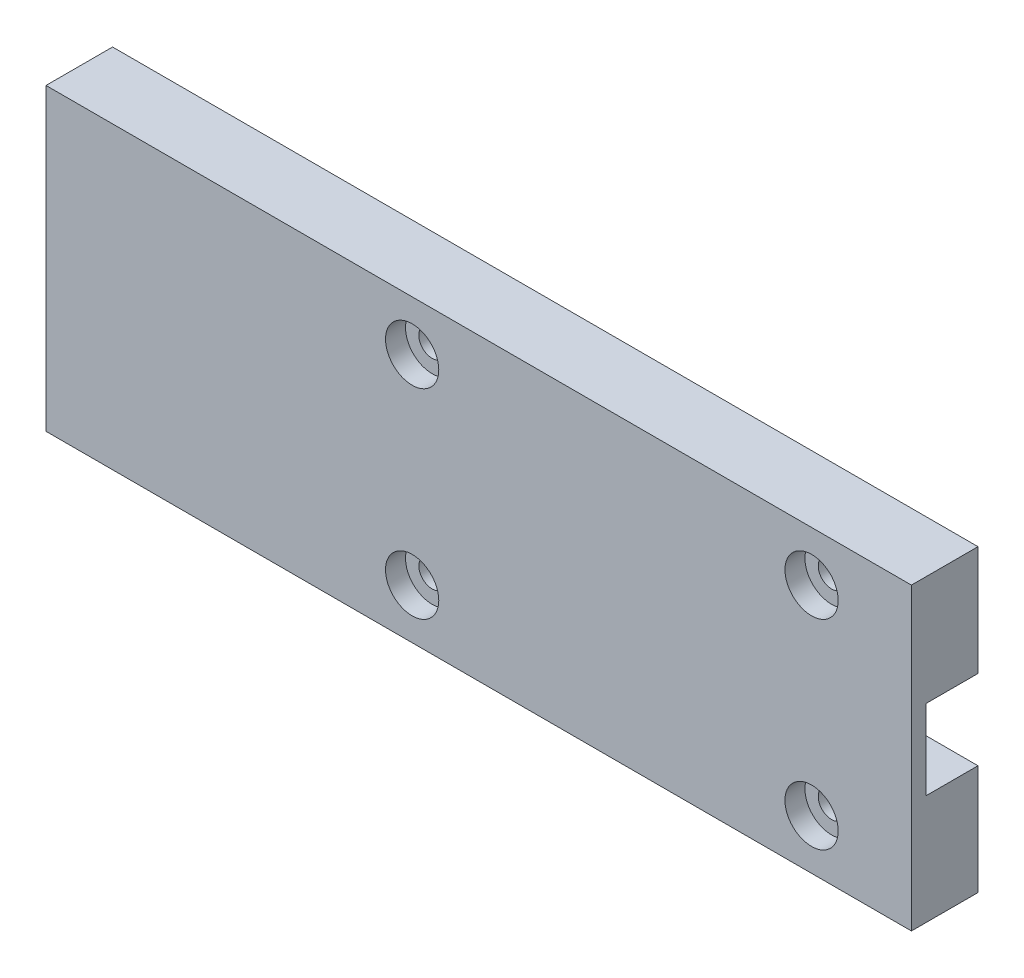
ISO-10303-21;
HEADER;
FILE_DESCRIPTION(('STEP AP214'),'2;1');
FILE_NAME('part.step','',(''),(''),'','','');
FILE_SCHEMA(('AUTOMOTIVE_DESIGN { 1 0 10303 214 1 1 1 1 }'));
ENDSEC;
DATA;
#1=APPLICATION_CONTEXT('core data for automotive mechanical design processes');
#2=APPLICATION_PROTOCOL_DEFINITION('international standard','automotive_design',2000,#1);
#3=PRODUCT_CONTEXT('',#1,'mechanical');
#4=PRODUCT('Part','Part','',(#3));
#5=PRODUCT_RELATED_PRODUCT_CATEGORY('part','',(#4));
#6=PRODUCT_DEFINITION_FORMATION('','',#4);
#7=PRODUCT_DEFINITION_CONTEXT('part definition',#1,'design');
#8=PRODUCT_DEFINITION('design','',#6,#7);
#9=PRODUCT_DEFINITION_SHAPE('','',#8);
#10=(LENGTH_UNIT() NAMED_UNIT(*) SI_UNIT(.MILLI.,.METRE.));
#11=(NAMED_UNIT(*) PLANE_ANGLE_UNIT() SI_UNIT($,.RADIAN.));
#12=(NAMED_UNIT(*) SI_UNIT($,.STERADIAN.) SOLID_ANGLE_UNIT());
#13=UNCERTAINTY_MEASURE_WITH_UNIT(LENGTH_MEASURE(1.E-05),#10,'distance_accuracy_value','');
#14=(GEOMETRIC_REPRESENTATION_CONTEXT(3) GLOBAL_UNCERTAINTY_ASSIGNED_CONTEXT((#13)) GLOBAL_UNIT_ASSIGNED_CONTEXT((#10,
#11,#12)) REPRESENTATION_CONTEXT('',''));
#15=CARTESIAN_POINT('',(0.,0.,0.));
#16=DIRECTION('',(0.,0.,1.));
#17=DIRECTION('',(1.,0.,0.));
#18=AXIS2_PLACEMENT_3D('',#15,#16,#17);
#19=CARTESIAN_POINT('',(114.99999999989,37.4999999998989,0.));
#20=DIRECTION('',(0.,0.,1.));
#21=DIRECTION('',(1.,0.,0.));
#22=AXIS2_PLACEMENT_3D('',#19,#20,#21);
#23=CYLINDRICAL_SURFACE('',#22,2.);
#24=CARTESIAN_POINT('',(114.99999999989,37.4999999998989,0.));
#25=DIRECTION('',(0.,0.,1.));
#26=DIRECTION('',(1.,0.,0.));
#27=AXIS2_PLACEMENT_3D('',#24,#25,#26);
#28=CIRCLE('',#27,2.);
#29=CARTESIAN_POINT('',(116.99999999989,37.4999999998989,0.));
#30=VERTEX_POINT('',#29);
#31=EDGE_CURVE('E203',#30,#30,#28,.T.);
#32=ORIENTED_EDGE('',*,*,#31,.F.);
#33=EDGE_LOOP('',(#32));
#34=FACE_BOUND('',#33,.T.);
#35=CARTESIAN_POINT('',(114.99999999989,37.4999999998989,7.));
#36=DIRECTION('',(0.,0.,1.));
#37=DIRECTION('',(1.,0.,0.));
#38=AXIS2_PLACEMENT_3D('',#35,#36,#37);
#39=CIRCLE('',#38,2.);
#40=CARTESIAN_POINT('',(116.99999999989,37.4999999998989,7.));
#41=VERTEX_POINT('',#40);
#42=EDGE_CURVE('E39',#41,#41,#39,.F.);
#43=ORIENTED_EDGE('',*,*,#42,.F.);
#44=EDGE_LOOP('',(#43));
#45=FACE_BOUND('',#44,.T.);
#46=ADVANCED_FACE('F35',(#34,#45),#23,.F.);
#47=CARTESIAN_POINT('',(54.99999999989,7.49999999989891,0.));
#48=DIRECTION('',(0.,0.,1.));
#49=DIRECTION('',(1.,0.,0.));
#50=AXIS2_PLACEMENT_3D('',#47,#48,#49);
#51=CYLINDRICAL_SURFACE('',#50,2.);
#52=CARTESIAN_POINT('',(54.99999999989,7.49999999989891,0.));
#53=DIRECTION('',(0.,0.,1.));
#54=DIRECTION('',(1.,0.,0.));
#55=AXIS2_PLACEMENT_3D('',#52,#53,#54);
#56=CIRCLE('',#55,2.);
#57=CARTESIAN_POINT('',(56.99999999989,7.49999999989891,0.));
#58=VERTEX_POINT('',#57);
#59=EDGE_CURVE('E196',#58,#58,#56,.T.);
#60=ORIENTED_EDGE('',*,*,#59,.F.);
#61=EDGE_LOOP('',(#60));
#62=FACE_BOUND('',#61,.T.);
#63=CARTESIAN_POINT('',(54.99999999989,7.49999999989891,7.));
#64=DIRECTION('',(0.,0.,1.));
#65=DIRECTION('',(1.,0.,0.));
#66=AXIS2_PLACEMENT_3D('',#63,#64,#65);
#67=CIRCLE('',#66,2.);
#68=CARTESIAN_POINT('',(56.99999999989,7.49999999989891,7.));
#69=VERTEX_POINT('',#68);
#70=EDGE_CURVE('E256',#69,#69,#67,.F.);
#71=ORIENTED_EDGE('',*,*,#70,.F.);
#72=EDGE_LOOP('',(#71));
#73=FACE_BOUND('',#72,.T.);
#74=ADVANCED_FACE('F266',(#62,#73),#51,.F.);
#75=CARTESIAN_POINT('',(114.99999999989,7.49999999989892,0.));
#76=DIRECTION('',(0.,0.,1.));
#77=DIRECTION('',(1.,0.,0.));
#78=AXIS2_PLACEMENT_3D('',#75,#76,#77);
#79=CYLINDRICAL_SURFACE('',#78,2.);
#80=CARTESIAN_POINT('',(114.99999999989,7.49999999989892,0.));
#81=DIRECTION('',(0.,0.,1.));
#82=DIRECTION('',(1.,0.,0.));
#83=AXIS2_PLACEMENT_3D('',#80,#81,#82);
#84=CIRCLE('',#83,2.);
#85=CARTESIAN_POINT('',(116.99999999989,7.49999999989892,0.));
#86=VERTEX_POINT('',#85);
#87=EDGE_CURVE('E199',#86,#86,#84,.T.);
#88=ORIENTED_EDGE('',*,*,#87,.F.);
#89=EDGE_LOOP('',(#88));
#90=FACE_BOUND('',#89,.T.);
#91=CARTESIAN_POINT('',(114.99999999989,7.49999999989892,7.));
#92=DIRECTION('',(0.,0.,1.));
#93=DIRECTION('',(1.,0.,0.));
#94=AXIS2_PLACEMENT_3D('',#91,#92,#93);
#95=CIRCLE('',#94,2.);
#96=CARTESIAN_POINT('',(116.99999999989,7.49999999989892,7.));
#97=VERTEX_POINT('',#96);
#98=EDGE_CURVE('E254',#97,#97,#95,.F.);
#99=ORIENTED_EDGE('',*,*,#98,.F.);
#100=EDGE_LOOP('',(#99));
#101=FACE_BOUND('',#100,.T.);
#102=ADVANCED_FACE('F272',(#90,#101),#79,.F.);
#103=CARTESIAN_POINT('',(54.99999999989,37.4999999998989,0.));
#104=DIRECTION('',(0.,0.,1.));
#105=DIRECTION('',(1.,0.,0.));
#106=AXIS2_PLACEMENT_3D('',#103,#104,#105);
#107=CYLINDRICAL_SURFACE('',#106,2.);
#108=CARTESIAN_POINT('',(54.99999999989,37.4999999998989,0.));
#109=DIRECTION('',(0.,0.,1.));
#110=DIRECTION('',(1.,0.,0.));
#111=AXIS2_PLACEMENT_3D('',#108,#109,#110);
#112=CIRCLE('',#111,2.);
#113=CARTESIAN_POINT('',(56.99999999989,37.4999999998989,0.));
#114=VERTEX_POINT('',#113);
#115=EDGE_CURVE('E200',#114,#114,#112,.T.);
#116=ORIENTED_EDGE('',*,*,#115,.F.);
#117=EDGE_LOOP('',(#116));
#118=FACE_BOUND('',#117,.T.);
#119=CARTESIAN_POINT('',(54.99999999989,37.4999999998989,7.));
#120=DIRECTION('',(0.,0.,1.));
#121=DIRECTION('',(1.,0.,0.));
#122=AXIS2_PLACEMENT_3D('',#119,#120,#121);
#123=CIRCLE('',#122,2.);
#124=CARTESIAN_POINT('',(56.99999999989,37.4999999998989,7.));
#125=VERTEX_POINT('',#124);
#126=EDGE_CURVE('E193',#125,#125,#123,.F.);
#127=ORIENTED_EDGE('',*,*,#126,.F.);
#128=EDGE_LOOP('',(#127));
#129=FACE_BOUND('',#128,.T.);
#130=ADVANCED_FACE('F310',(#118,#129),#107,.F.);
#131=CARTESIAN_POINT('',(0.,0.,10.));
#132=DIRECTION('',(1.,0.,0.));
#133=DIRECTION('',(0.,0.,-1.));
#134=AXIS2_PLACEMENT_3D('',#131,#132,#133);
#135=PLANE('',#134);
#136=DIRECTION('',(0.,-1.,0.));
#137=VECTOR('',#136,1.);
#138=CARTESIAN_POINT('',(0.,0.,0.));
#139=LINE('',#138,#137);
#140=CARTESIAN_POINT('',(0.,44.9999999997978,0.));
#141=VERTEX_POINT('',#140);
#142=CARTESIAN_POINT('',(0.,0.,0.));
#143=VERTEX_POINT('',#142);
#144=EDGE_CURVE('E223',#141,#143,#139,.T.);
#145=ORIENTED_EDGE('',*,*,#144,.T.);
#146=DIRECTION('',(0.,0.,-1.));
#147=VECTOR('',#146,1.);
#148=CARTESIAN_POINT('',(0.,0.,10.));
#149=LINE('',#148,#147);
#150=CARTESIAN_POINT('',(0.,0.,10.));
#151=VERTEX_POINT('',#150);
#152=EDGE_CURVE('E11',#151,#143,#149,.T.);
#153=ORIENTED_EDGE('',*,*,#152,.F.);
#154=DIRECTION('',(0.,-1.,0.));
#155=VECTOR('',#154,1.);
#156=CARTESIAN_POINT('',(0.,0.,10.));
#157=LINE('',#156,#155);
#158=CARTESIAN_POINT('',(0.,44.9999999997978,10.));
#159=VERTEX_POINT('',#158);
#160=EDGE_CURVE('E225',#159,#151,#157,.T.);
#161=ORIENTED_EDGE('',*,*,#160,.F.);
#162=DIRECTION('',(0.,0.,-1.));
#163=VECTOR('',#162,1.);
#164=CARTESIAN_POINT('',(0.,44.9999999997978,10.));
#165=LINE('',#164,#163);
#166=EDGE_CURVE('E235',#159,#141,#165,.T.);
#167=ORIENTED_EDGE('',*,*,#166,.T.);
#168=EDGE_LOOP('',(#145,#153,#161,#167));
#169=FACE_BOUND('',#168,.T.);
#170=ADVANCED_FACE('F37',(#169),#135,.F.);
#171=CARTESIAN_POINT('',(0.,0.,10.));
#172=DIRECTION('',(0.,1.,0.));
#173=DIRECTION('',(0.,0.,1.));
#174=AXIS2_PLACEMENT_3D('',#171,#172,#173);
#175=PLANE('',#174);
#176=DIRECTION('',(1.,0.,0.));
#177=VECTOR('',#176,1.);
#178=CARTESIAN_POINT('',(0.,0.,0.));
#179=LINE('',#178,#177);
#180=CARTESIAN_POINT('',(129.99999999989,0.,0.));
#181=VERTEX_POINT('',#180);
#182=EDGE_CURVE('E238',#143,#181,#179,.T.);
#183=ORIENTED_EDGE('',*,*,#182,.T.);
#184=DIRECTION('',(0.,0.,-1.));
#185=VECTOR('',#184,1.);
#186=CARTESIAN_POINT('',(129.99999999989,0.,10.));
#187=LINE('',#186,#185);
#188=CARTESIAN_POINT('',(129.99999999989,0.,10.));
#189=VERTEX_POINT('',#188);
#190=EDGE_CURVE('E44',#189,#181,#187,.T.);
#191=ORIENTED_EDGE('',*,*,#190,.F.);
#192=DIRECTION('',(1.,0.,0.));
#193=VECTOR('',#192,1.);
#194=CARTESIAN_POINT('',(0.,0.,10.));
#195=LINE('',#194,#193);
#196=EDGE_CURVE('E228',#151,#189,#195,.T.);
#197=ORIENTED_EDGE('',*,*,#196,.F.);
#198=ORIENTED_EDGE('',*,*,#152,.T.);
#199=EDGE_LOOP('',(#183,#191,#197,#198));
#200=FACE_BOUND('',#199,.T.);
#201=ADVANCED_FACE('F303',(#200),#175,.F.);
#202=CARTESIAN_POINT('',(129.99999999989,0.,10.));
#203=DIRECTION('',(-1.,0.,0.));
#204=DIRECTION('',(0.,0.,1.));
#205=AXIS2_PLACEMENT_3D('',#202,#203,#204);
#206=PLANE('',#205);
#207=DIRECTION('',(0.,-1.,0.));
#208=VECTOR('',#207,1.);
#209=CARTESIAN_POINT('',(129.99999999989,16.5,7.8));
#210=LINE('',#209,#208);
#211=CARTESIAN_POINT('',(129.99999999989,28.4999999997978,7.8));
#212=VERTEX_POINT('',#211);
#213=CARTESIAN_POINT('',(129.99999999989,16.5,7.8));
#214=VERTEX_POINT('',#213);
#215=EDGE_CURVE('E209',#212,#214,#210,.T.);
#216=ORIENTED_EDGE('',*,*,#215,.F.);
#217=DIRECTION('',(0.,0.,-1.));
#218=VECTOR('',#217,1.);
#219=CARTESIAN_POINT('',(129.99999999989,28.4999999997978,7.8));
#220=LINE('',#219,#218);
#221=CARTESIAN_POINT('',(129.99999999989,28.4999999997978,0.));
#222=VERTEX_POINT('',#221);
#223=EDGE_CURVE('E220',#212,#222,#220,.T.);
#224=ORIENTED_EDGE('',*,*,#223,.T.);
#225=DIRECTION('',(0.,1.,0.));
#226=VECTOR('',#225,1.);
#227=CARTESIAN_POINT('',(129.99999999989,0.,0.));
#228=LINE('',#227,#226);
#229=CARTESIAN_POINT('',(129.99999999989,44.9999999997978,0.));
#230=VERTEX_POINT('',#229);
#231=EDGE_CURVE('E240',#222,#230,#228,.T.);
#232=ORIENTED_EDGE('',*,*,#231,.T.);
#233=DIRECTION('',(0.,0.,-1.));
#234=VECTOR('',#233,1.);
#235=CARTESIAN_POINT('',(129.99999999989,44.9999999997978,10.));
#236=LINE('',#235,#234);
#237=CARTESIAN_POINT('',(129.99999999989,44.9999999997978,10.));
#238=VERTEX_POINT('',#237);
#239=EDGE_CURVE('E247',#238,#230,#236,.T.);
#240=ORIENTED_EDGE('',*,*,#239,.F.);
#241=DIRECTION('',(0.,1.,0.));
#242=VECTOR('',#241,1.);
#243=CARTESIAN_POINT('',(129.99999999989,0.,10.));
#244=LINE('',#243,#242);
#245=EDGE_CURVE('E231',#189,#238,#244,.T.);
#246=ORIENTED_EDGE('',*,*,#245,.F.);
#247=ORIENTED_EDGE('',*,*,#190,.T.);
#248=CARTESIAN_POINT('',(129.99999999989,16.5,0.));
#249=VERTEX_POINT('',#248);
#250=EDGE_CURVE('E241',#181,#249,#228,.T.);
#251=ORIENTED_EDGE('',*,*,#250,.T.);
#252=DIRECTION('',(0.,0.,-1.));
#253=VECTOR('',#252,1.);
#254=CARTESIAN_POINT('',(129.99999999989,16.5,7.8));
#255=LINE('',#254,#253);
#256=EDGE_CURVE('E60',#214,#249,#255,.T.);
#257=ORIENTED_EDGE('',*,*,#256,.F.);
#258=EDGE_LOOP('',(#216,#224,#232,#240,#246,#247,#251,#257));
#259=FACE_BOUND('',#258,.T.);
#260=ADVANCED_FACE('F300',(#259),#206,.F.);
#261=CARTESIAN_POINT('',(0.,44.9999999997978,10.));
#262=DIRECTION('',(0.,-1.,0.));
#263=DIRECTION('',(0.,0.,-1.));
#264=AXIS2_PLACEMENT_3D('',#261,#262,#263);
#265=PLANE('',#264);
#266=DIRECTION('',(-1.,0.,0.));
#267=VECTOR('',#266,1.);
#268=CARTESIAN_POINT('',(0.,44.9999999997978,0.));
#269=LINE('',#268,#267);
#270=EDGE_CURVE('E229',#230,#141,#269,.T.);
#271=ORIENTED_EDGE('',*,*,#270,.T.);
#272=ORIENTED_EDGE('',*,*,#166,.F.);
#273=DIRECTION('',(-1.,0.,0.));
#274=VECTOR('',#273,1.);
#275=CARTESIAN_POINT('',(0.,44.9999999997978,10.));
#276=LINE('',#275,#274);
#277=EDGE_CURVE('E233',#238,#159,#276,.T.);
#278=ORIENTED_EDGE('',*,*,#277,.F.);
#279=ORIENTED_EDGE('',*,*,#239,.T.);
#280=EDGE_LOOP('',(#271,#272,#278,#279));
#281=FACE_BOUND('',#280,.T.);
#282=ADVANCED_FACE('F293',(#281),#265,.F.);
#283=CARTESIAN_POINT('',(0.,0.,10.));
#284=DIRECTION('',(0.,0.,-1.));
#285=DIRECTION('',(-1.,0.,0.));
#286=AXIS2_PLACEMENT_3D('',#283,#284,#285);
#287=PLANE('',#286);
#288=CARTESIAN_POINT('',(54.99999999989,7.49999999989891,10.));
#289=DIRECTION('',(0.,0.,1.));
#290=DIRECTION('',(1.,0.,0.));
#291=AXIS2_PLACEMENT_3D('',#288,#289,#290);
#292=CIRCLE('',#291,4.00000000000001);
#293=CARTESIAN_POINT('',(58.99999999989,7.49999999989891,10.));
#294=VERTEX_POINT('',#293);
#295=EDGE_CURVE('E171',#294,#294,#292,.T.);
#296=ORIENTED_EDGE('',*,*,#295,.F.);
#297=EDGE_LOOP('',(#296));
#298=FACE_BOUND('',#297,.T.);
#299=CARTESIAN_POINT('',(114.99999999989,7.49999999989892,10.));
#300=DIRECTION('',(0.,0.,1.));
#301=DIRECTION('',(1.,0.,0.));
#302=AXIS2_PLACEMENT_3D('',#299,#300,#301);
#303=CIRCLE('',#302,4.00000000000001);
#304=CARTESIAN_POINT('',(118.99999999989,7.49999999989892,10.));
#305=VERTEX_POINT('',#304);
#306=EDGE_CURVE('E182',#305,#305,#303,.T.);
#307=ORIENTED_EDGE('',*,*,#306,.F.);
#308=EDGE_LOOP('',(#307));
#309=FACE_BOUND('',#308,.T.);
#310=CARTESIAN_POINT('',(114.99999999989,37.4999999998989,10.));
#311=DIRECTION('',(0.,0.,1.));
#312=DIRECTION('',(1.,0.,0.));
#313=AXIS2_PLACEMENT_3D('',#310,#311,#312);
#314=CIRCLE('',#313,4.00000000000001);
#315=CARTESIAN_POINT('',(118.99999999989,37.4999999998989,10.));
#316=VERTEX_POINT('',#315);
#317=EDGE_CURVE('E176',#316,#316,#314,.T.);
#318=ORIENTED_EDGE('',*,*,#317,.F.);
#319=EDGE_LOOP('',(#318));
#320=FACE_BOUND('',#319,.T.);
#321=CARTESIAN_POINT('',(54.99999999989,37.4999999998989,10.));
#322=DIRECTION('',(0.,0.,1.));
#323=DIRECTION('',(1.,0.,0.));
#324=AXIS2_PLACEMENT_3D('',#321,#322,#323);
#325=CIRCLE('',#324,4.00000000000001);
#326=CARTESIAN_POINT('',(58.99999999989,37.4999999998989,10.));
#327=VERTEX_POINT('',#326);
#328=EDGE_CURVE('E175',#327,#327,#325,.T.);
#329=ORIENTED_EDGE('',*,*,#328,.F.);
#330=EDGE_LOOP('',(#329));
#331=FACE_BOUND('',#330,.T.);
#332=ORIENTED_EDGE('',*,*,#160,.T.);
#333=ORIENTED_EDGE('',*,*,#196,.T.);
#334=ORIENTED_EDGE('',*,*,#245,.T.);
#335=ORIENTED_EDGE('',*,*,#277,.T.);
#336=EDGE_LOOP('',(#332,#333,#334,#335));
#337=FACE_BOUND('',#336,.T.);
#338=ADVANCED_FACE('F290',(#298,#309,#320,#331,#337),#287,.F.);
#339=CARTESIAN_POINT('',(0.,0.,0.));
#340=DIRECTION('',(0.,0.,-1.));
#341=DIRECTION('',(-1.,0.,0.));
#342=AXIS2_PLACEMENT_3D('',#339,#340,#341);
#343=PLANE('',#342);
#344=DIRECTION('',(0.,-1.,0.));
#345=VECTOR('',#344,1.);
#346=CARTESIAN_POINT('',(47.5000000004442,42.999999999998,0.));
#347=LINE('',#346,#345);
#348=CARTESIAN_POINT('',(47.5000000004442,42.999999999998,0.));
#349=VERTEX_POINT('',#348);
#350=CARTESIAN_POINT('',(47.5000000004442,28.4999999997978,0.));
#351=VERTEX_POINT('',#350);
#352=EDGE_CURVE('E153',#349,#351,#347,.T.);
#353=ORIENTED_EDGE('',*,*,#352,.F.);
#354=DIRECTION('',(1.,0.,0.));
#355=VECTOR('',#354,1.);
#356=CARTESIAN_POINT('',(6.50000000044414,42.999999999998,0.));
#357=LINE('',#356,#355);
#358=CARTESIAN_POINT('',(6.50000000044414,42.999999999998,0.));
#359=VERTEX_POINT('',#358);
#360=EDGE_CURVE('E143',#359,#349,#357,.T.);
#361=ORIENTED_EDGE('',*,*,#360,.F.);
#362=DIRECTION('',(0.,1.,0.));
#363=VECTOR('',#362,1.);
#364=CARTESIAN_POINT('',(6.50000000044414,42.999999999998,0.));
#365=LINE('',#364,#363);
#366=CARTESIAN_POINT('',(6.50000000044413,1.99999999999795,0.));
#367=VERTEX_POINT('',#366);
#368=EDGE_CURVE('E157',#367,#359,#365,.T.);
#369=ORIENTED_EDGE('',*,*,#368,.F.);
#370=DIRECTION('',(-1.,0.,0.));
#371=VECTOR('',#370,1.);
#372=CARTESIAN_POINT('',(6.50000000044413,1.99999999999795,0.));
#373=LINE('',#372,#371);
#374=CARTESIAN_POINT('',(47.5000000004441,1.99999999999797,0.));
#375=VERTEX_POINT('',#374);
#376=EDGE_CURVE('E150',#375,#367,#373,.T.);
#377=ORIENTED_EDGE('',*,*,#376,.F.);
#378=CARTESIAN_POINT('',(47.5000000004441,16.5,0.));
#379=VERTEX_POINT('',#378);
#380=EDGE_CURVE('E322',#379,#375,#347,.T.);
#381=ORIENTED_EDGE('',*,*,#380,.F.);
#382=DIRECTION('',(-1.,0.,0.));
#383=VECTOR('',#382,1.);
#384=CARTESIAN_POINT('',(129.99999999989,16.5,0.));
#385=LINE('',#384,#383);
#386=EDGE_CURVE('E208',#249,#379,#385,.T.);
#387=ORIENTED_EDGE('',*,*,#386,.F.);
#388=ORIENTED_EDGE('',*,*,#250,.F.);
#389=ORIENTED_EDGE('',*,*,#182,.F.);
#390=ORIENTED_EDGE('',*,*,#144,.F.);
#391=ORIENTED_EDGE('',*,*,#270,.F.);
#392=ORIENTED_EDGE('',*,*,#231,.F.);
#393=DIRECTION('',(1.,0.,0.));
#394=VECTOR('',#393,1.);
#395=CARTESIAN_POINT('',(129.99999999989,28.4999999997978,0.));
#396=LINE('',#395,#394);
#397=EDGE_CURVE('E213',#351,#222,#396,.T.);
#398=ORIENTED_EDGE('',*,*,#397,.F.);
#399=EDGE_LOOP('',(#353,#361,#369,#377,#381,#387,#388,#389,#390,#391,#392,#398));
#400=FACE_BOUND('',#399,.T.);
#401=ORIENTED_EDGE('',*,*,#115,.T.);
#402=EDGE_LOOP('',(#401));
#403=FACE_BOUND('',#402,.T.);
#404=ORIENTED_EDGE('',*,*,#87,.T.);
#405=EDGE_LOOP('',(#404));
#406=FACE_BOUND('',#405,.T.);
#407=ORIENTED_EDGE('',*,*,#59,.T.);
#408=EDGE_LOOP('',(#407));
#409=FACE_BOUND('',#408,.T.);
#410=ORIENTED_EDGE('',*,*,#31,.T.);
#411=EDGE_LOOP('',(#410));
#412=FACE_BOUND('',#411,.T.);
#413=ADVANCED_FACE('F286',(#400,#403,#406,#409,#412),#343,.T.);
#414=CARTESIAN_POINT('',(129.99999999989,28.4999999997978,7.8));
#415=DIRECTION('',(0.,1.,0.));
#416=DIRECTION('',(0.,0.,1.));
#417=AXIS2_PLACEMENT_3D('',#414,#415,#416);
#418=PLANE('',#417);
#419=DIRECTION('',(1.,0.,0.));
#420=VECTOR('',#419,1.);
#421=CARTESIAN_POINT('',(129.99999999989,28.4999999997978,7.8));
#422=LINE('',#421,#420);
#423=CARTESIAN_POINT('',(47.5000000004442,28.4999999997978,7.8));
#424=VERTEX_POINT('',#423);
#425=EDGE_CURVE('E216',#424,#212,#422,.T.);
#426=ORIENTED_EDGE('',*,*,#425,.F.);
#427=DIRECTION('',(0.,0.,-1.));
#428=VECTOR('',#427,1.);
#429=CARTESIAN_POINT('',(47.5000000004442,28.4999999997978,7.8));
#430=LINE('',#429,#428);
#431=EDGE_CURVE('E132',#424,#351,#430,.T.);
#432=ORIENTED_EDGE('',*,*,#431,.T.);
#433=ORIENTED_EDGE('',*,*,#397,.T.);
#434=ORIENTED_EDGE('',*,*,#223,.F.);
#435=EDGE_LOOP('',(#426,#432,#433,#434));
#436=FACE_BOUND('',#435,.T.);
#437=ADVANCED_FACE('F283',(#436),#418,.F.);
#438=CARTESIAN_POINT('',(129.99999999989,16.5,7.8));
#439=DIRECTION('',(0.,-1.,0.));
#440=DIRECTION('',(0.,0.,-1.));
#441=AXIS2_PLACEMENT_3D('',#438,#439,#440);
#442=PLANE('',#441);
#443=ORIENTED_EDGE('',*,*,#386,.T.);
#444=DIRECTION('',(0.,0.,1.));
#445=VECTOR('',#444,1.);
#446=CARTESIAN_POINT('',(47.5000000004442,16.5,7.8));
#447=LINE('',#446,#445);
#448=CARTESIAN_POINT('',(47.5000000004441,16.5,7.8));
#449=VERTEX_POINT('',#448);
#450=EDGE_CURVE('E168',#379,#449,#447,.T.);
#451=ORIENTED_EDGE('',*,*,#450,.T.);
#452=DIRECTION('',(-1.,0.,0.));
#453=VECTOR('',#452,1.);
#454=CARTESIAN_POINT('',(129.99999999989,16.5,7.8));
#455=LINE('',#454,#453);
#456=EDGE_CURVE('E212',#214,#449,#455,.T.);
#457=ORIENTED_EDGE('',*,*,#456,.F.);
#458=ORIENTED_EDGE('',*,*,#256,.T.);
#459=EDGE_LOOP('',(#443,#451,#457,#458));
#460=FACE_BOUND('',#459,.T.);
#461=ADVANCED_FACE('F282',(#460),#442,.F.);
#462=CARTESIAN_POINT('',(0.,0.,7.8));
#463=DIRECTION('',(0.,0.,1.));
#464=DIRECTION('',(1.,0.,0.));
#465=AXIS2_PLACEMENT_3D('',#462,#463,#464);
#466=PLANE('',#465);
#467=DIRECTION('',(0.,-1.,0.));
#468=VECTOR('',#467,1.);
#469=CARTESIAN_POINT('',(47.5000000004442,42.999999999998,7.8));
#470=LINE('',#469,#468);
#471=CARTESIAN_POINT('',(47.5000000004442,42.999999999998,7.8));
#472=VERTEX_POINT('',#471);
#473=EDGE_CURVE('E126',#472,#424,#470,.T.);
#474=ORIENTED_EDGE('',*,*,#473,.T.);
#475=ORIENTED_EDGE('',*,*,#425,.T.);
#476=ORIENTED_EDGE('',*,*,#215,.T.);
#477=ORIENTED_EDGE('',*,*,#456,.T.);
#478=CARTESIAN_POINT('',(47.5000000004441,1.99999999999797,7.8));
#479=VERTEX_POINT('',#478);
#480=EDGE_CURVE('E52',#449,#479,#470,.T.);
#481=ORIENTED_EDGE('',*,*,#480,.T.);
#482=DIRECTION('',(-1.,0.,0.));
#483=VECTOR('',#482,1.);
#484=CARTESIAN_POINT('',(6.50000000044413,1.99999999999795,7.8));
#485=LINE('',#484,#483);
#486=CARTESIAN_POINT('',(6.50000000044413,1.99999999999795,7.8));
#487=VERTEX_POINT('',#486);
#488=EDGE_CURVE('E162',#479,#487,#485,.T.);
#489=ORIENTED_EDGE('',*,*,#488,.T.);
#490=DIRECTION('',(0.,1.,0.));
#491=VECTOR('',#490,1.);
#492=CARTESIAN_POINT('',(6.50000000044414,42.999999999998,7.8));
#493=LINE('',#492,#491);
#494=CARTESIAN_POINT('',(6.50000000044414,42.999999999998,7.8));
#495=VERTEX_POINT('',#494);
#496=EDGE_CURVE('E148',#487,#495,#493,.T.);
#497=ORIENTED_EDGE('',*,*,#496,.T.);
#498=DIRECTION('',(1.,0.,0.));
#499=VECTOR('',#498,1.);
#500=CARTESIAN_POINT('',(6.50000000044414,42.999999999998,7.8));
#501=LINE('',#500,#499);
#502=EDGE_CURVE('E140',#495,#472,#501,.T.);
#503=ORIENTED_EDGE('',*,*,#502,.T.);
#504=EDGE_LOOP('',(#474,#475,#476,#477,#481,#489,#497,#503));
#505=FACE_BOUND('',#504,.T.);
#506=ADVANCED_FACE('F146',(#505),#466,.F.);
#507=CARTESIAN_POINT('',(54.99999999989,37.4999999998989,7.));
#508=DIRECTION('',(0.,0.,1.));
#509=DIRECTION('',(1.,0.,0.));
#510=AXIS2_PLACEMENT_3D('',#507,#508,#509);
#511=PLANE('',#510);
#512=CARTESIAN_POINT('',(54.99999999989,37.4999999998989,7.));
#513=DIRECTION('',(0.,0.,1.));
#514=DIRECTION('',(1.,0.,0.));
#515=AXIS2_PLACEMENT_3D('',#512,#513,#514);
#516=CIRCLE('',#515,4.00000000000001);
#517=CARTESIAN_POINT('',(58.99999999989,37.4999999998989,7.));
#518=VERTEX_POINT('',#517);
#519=EDGE_CURVE('E190',#518,#518,#516,.T.);
#520=ORIENTED_EDGE('',*,*,#519,.T.);
#521=EDGE_LOOP('',(#520));
#522=FACE_BOUND('',#521,.T.);
#523=ORIENTED_EDGE('',*,*,#126,.T.);
#524=EDGE_LOOP('',(#523));
#525=FACE_BOUND('',#524,.T.);
#526=ADVANCED_FACE('F281',(#522,#525),#511,.T.);
#527=CARTESIAN_POINT('',(54.99999999989,37.4999999998989,7.));
#528=DIRECTION('',(0.,0.,1.));
#529=DIRECTION('',(1.,0.,0.));
#530=AXIS2_PLACEMENT_3D('',#527,#528,#529);
#531=CYLINDRICAL_SURFACE('',#530,4.00000000000001);
#532=ORIENTED_EDGE('',*,*,#519,.F.);
#533=EDGE_LOOP('',(#532));
#534=FACE_BOUND('',#533,.T.);
#535=ORIENTED_EDGE('',*,*,#328,.T.);
#536=EDGE_LOOP('',(#535));
#537=FACE_BOUND('',#536,.T.);
#538=ADVANCED_FACE('F363',(#534,#537),#531,.F.);
#539=CARTESIAN_POINT('',(114.99999999989,7.49999999989892,7.));
#540=DIRECTION('',(0.,0.,1.));
#541=DIRECTION('',(1.,0.,0.));
#542=AXIS2_PLACEMENT_3D('',#539,#540,#541);
#543=PLANE('',#542);
#544=CARTESIAN_POINT('',(114.99999999989,7.49999999989892,7.));
#545=DIRECTION('',(0.,0.,1.));
#546=DIRECTION('',(1.,0.,0.));
#547=AXIS2_PLACEMENT_3D('',#544,#545,#546);
#548=CIRCLE('',#547,4.00000000000001);
#549=CARTESIAN_POINT('',(118.99999999989,7.49999999989892,7.));
#550=VERTEX_POINT('',#549);
#551=EDGE_CURVE('E179',#550,#550,#548,.T.);
#552=ORIENTED_EDGE('',*,*,#551,.T.);
#553=EDGE_LOOP('',(#552));
#554=FACE_BOUND('',#553,.T.);
#555=ORIENTED_EDGE('',*,*,#98,.T.);
#556=EDGE_LOOP('',(#555));
#557=FACE_BOUND('',#556,.T.);
#558=ADVANCED_FACE('F359',(#554,#557),#543,.T.);
#559=CARTESIAN_POINT('',(114.99999999989,7.49999999989892,7.));
#560=DIRECTION('',(0.,0.,1.));
#561=DIRECTION('',(1.,0.,0.));
#562=AXIS2_PLACEMENT_3D('',#559,#560,#561);
#563=CYLINDRICAL_SURFACE('',#562,4.00000000000001);
#564=ORIENTED_EDGE('',*,*,#551,.F.);
#565=EDGE_LOOP('',(#564));
#566=FACE_BOUND('',#565,.T.);
#567=ORIENTED_EDGE('',*,*,#306,.T.);
#568=EDGE_LOOP('',(#567));
#569=FACE_BOUND('',#568,.T.);
#570=ADVANCED_FACE('F362',(#566,#569),#563,.F.);
#571=CARTESIAN_POINT('',(54.99999999989,7.49999999989891,7.));
#572=DIRECTION('',(0.,0.,1.));
#573=DIRECTION('',(1.,0.,0.));
#574=AXIS2_PLACEMENT_3D('',#571,#572,#573);
#575=PLANE('',#574);
#576=CARTESIAN_POINT('',(54.99999999989,7.49999999989891,7.));
#577=DIRECTION('',(0.,0.,1.));
#578=DIRECTION('',(1.,0.,0.));
#579=AXIS2_PLACEMENT_3D('',#576,#577,#578);
#580=CIRCLE('',#579,4.00000000000001);
#581=CARTESIAN_POINT('',(58.99999999989,7.49999999989891,7.));
#582=VERTEX_POINT('',#581);
#583=EDGE_CURVE('E185',#582,#582,#580,.T.);
#584=ORIENTED_EDGE('',*,*,#583,.T.);
#585=EDGE_LOOP('',(#584));
#586=FACE_BOUND('',#585,.T.);
#587=ORIENTED_EDGE('',*,*,#70,.T.);
#588=EDGE_LOOP('',(#587));
#589=FACE_BOUND('',#588,.T.);
#590=ADVANCED_FACE('F367',(#586,#589),#575,.T.);
#591=CARTESIAN_POINT('',(54.99999999989,7.49999999989891,7.));
#592=DIRECTION('',(0.,0.,1.));
#593=DIRECTION('',(1.,0.,0.));
#594=AXIS2_PLACEMENT_3D('',#591,#592,#593);
#595=CYLINDRICAL_SURFACE('',#594,4.00000000000001);
#596=ORIENTED_EDGE('',*,*,#583,.F.);
#597=EDGE_LOOP('',(#596));
#598=FACE_BOUND('',#597,.T.);
#599=ORIENTED_EDGE('',*,*,#295,.T.);
#600=EDGE_LOOP('',(#599));
#601=FACE_BOUND('',#600,.T.);
#602=ADVANCED_FACE('F354',(#598,#601),#595,.F.);
#603=CARTESIAN_POINT('',(114.99999999989,37.4999999998989,7.));
#604=DIRECTION('',(0.,0.,1.));
#605=DIRECTION('',(1.,0.,0.));
#606=AXIS2_PLACEMENT_3D('',#603,#604,#605);
#607=PLANE('',#606);
#608=CARTESIAN_POINT('',(114.99999999989,37.4999999998989,7.));
#609=DIRECTION('',(0.,0.,1.));
#610=DIRECTION('',(1.,0.,0.));
#611=AXIS2_PLACEMENT_3D('',#608,#609,#610);
#612=CIRCLE('',#611,4.00000000000001);
#613=CARTESIAN_POINT('',(118.99999999989,37.4999999998989,7.));
#614=VERTEX_POINT('',#613);
#615=EDGE_CURVE('E172',#614,#614,#612,.T.);
#616=ORIENTED_EDGE('',*,*,#615,.T.);
#617=EDGE_LOOP('',(#616));
#618=FACE_BOUND('',#617,.T.);
#619=ORIENTED_EDGE('',*,*,#42,.T.);
#620=EDGE_LOOP('',(#619));
#621=FACE_BOUND('',#620,.T.);
#622=ADVANCED_FACE('F263',(#618,#621),#607,.T.);
#623=CARTESIAN_POINT('',(114.99999999989,37.4999999998989,7.));
#624=DIRECTION('',(0.,0.,1.));
#625=DIRECTION('',(1.,0.,0.));
#626=AXIS2_PLACEMENT_3D('',#623,#624,#625);
#627=CYLINDRICAL_SURFACE('',#626,4.00000000000001);
#628=ORIENTED_EDGE('',*,*,#615,.F.);
#629=EDGE_LOOP('',(#628));
#630=FACE_BOUND('',#629,.T.);
#631=ORIENTED_EDGE('',*,*,#317,.T.);
#632=EDGE_LOOP('',(#631));
#633=FACE_BOUND('',#632,.T.);
#634=ADVANCED_FACE('F348',(#630,#633),#627,.F.);
#635=CARTESIAN_POINT('',(47.5000000004442,42.999999999998,65.7827560572969));
#636=DIRECTION('',(1.,0.,0.));
#637=DIRECTION('',(0.,1.,0.));
#638=AXIS2_PLACEMENT_3D('',#635,#636,#637);
#639=PLANE('',#638);
#640=ORIENTED_EDGE('',*,*,#473,.F.);
#641=DIRECTION('',(0.,0.,-1.));
#642=VECTOR('',#641,1.);
#643=CARTESIAN_POINT('',(47.5000000004442,42.999999999998,65.7827560572969));
#644=LINE('',#643,#642);
#645=EDGE_CURVE('E129',#472,#349,#644,.T.);
#646=ORIENTED_EDGE('',*,*,#645,.T.);
#647=ORIENTED_EDGE('',*,*,#352,.T.);
#648=ORIENTED_EDGE('',*,*,#431,.F.);
#649=EDGE_LOOP('',(#640,#646,#647,#648));
#650=FACE_BOUND('',#649,.T.);
#651=ADVANCED_FACE('F128',(#650),#639,.F.);
#652=ORIENTED_EDGE('',*,*,#380,.T.);
#653=DIRECTION('',(0.,0.,-1.));
#654=VECTOR('',#653,1.);
#655=CARTESIAN_POINT('',(47.5000000004441,1.99999999999797,65.7827560572969));
#656=LINE('',#655,#654);
#657=EDGE_CURVE('E136',#479,#375,#656,.T.);
#658=ORIENTED_EDGE('',*,*,#657,.F.);
#659=ORIENTED_EDGE('',*,*,#480,.F.);
#660=ORIENTED_EDGE('',*,*,#450,.F.);
#661=EDGE_LOOP('',(#652,#658,#659,#660));
#662=FACE_BOUND('',#661,.T.);
#663=ADVANCED_FACE('F340',(#662),#639,.F.);
#664=CARTESIAN_POINT('',(6.50000000044414,42.999999999998,65.7827560572969));
#665=DIRECTION('',(0.,1.,0.));
#666=DIRECTION('',(-1.,0.,0.));
#667=AXIS2_PLACEMENT_3D('',#664,#665,#666);
#668=PLANE('',#667);
#669=DIRECTION('',(0.,0.,-1.));
#670=VECTOR('',#669,1.);
#671=CARTESIAN_POINT('',(6.50000000044414,42.999999999998,65.7827560572969));
#672=LINE('',#671,#670);
#673=EDGE_CURVE('E160',#495,#359,#672,.T.);
#674=ORIENTED_EDGE('',*,*,#673,.T.);
#675=ORIENTED_EDGE('',*,*,#360,.T.);
#676=ORIENTED_EDGE('',*,*,#645,.F.);
#677=ORIENTED_EDGE('',*,*,#502,.F.);
#678=EDGE_LOOP('',(#674,#675,#676,#677));
#679=FACE_BOUND('',#678,.T.);
#680=ADVANCED_FACE('F139',(#679),#668,.F.);
#681=CARTESIAN_POINT('',(6.50000000044413,1.99999999999795,65.7827560572969));
#682=DIRECTION('',(0.,-1.,0.));
#683=DIRECTION('',(1.,0.,0.));
#684=AXIS2_PLACEMENT_3D('',#681,#682,#683);
#685=PLANE('',#684);
#686=ORIENTED_EDGE('',*,*,#657,.T.);
#687=ORIENTED_EDGE('',*,*,#376,.T.);
#688=DIRECTION('',(0.,0.,-1.));
#689=VECTOR('',#688,1.);
#690=CARTESIAN_POINT('',(6.50000000044413,1.99999999999795,65.7827560572969));
#691=LINE('',#690,#689);
#692=EDGE_CURVE('E161',#487,#367,#691,.T.);
#693=ORIENTED_EDGE('',*,*,#692,.F.);
#694=ORIENTED_EDGE('',*,*,#488,.F.);
#695=EDGE_LOOP('',(#686,#687,#693,#694));
#696=FACE_BOUND('',#695,.T.);
#697=ADVANCED_FACE('F339',(#696),#685,.F.);
#698=CARTESIAN_POINT('',(6.50000000044414,42.999999999998,65.7827560572969));
#699=DIRECTION('',(-1.,0.,0.));
#700=DIRECTION('',(0.,-1.,0.));
#701=AXIS2_PLACEMENT_3D('',#698,#699,#700);
#702=PLANE('',#701);
#703=ORIENTED_EDGE('',*,*,#692,.T.);
#704=ORIENTED_EDGE('',*,*,#368,.T.);
#705=ORIENTED_EDGE('',*,*,#673,.F.);
#706=ORIENTED_EDGE('',*,*,#496,.F.);
#707=EDGE_LOOP('',(#703,#704,#705,#706));
#708=FACE_BOUND('',#707,.T.);
#709=ADVANCED_FACE('F336',(#708),#702,.F.);
#710=CLOSED_SHELL('',(#46,#74,#102,#130,#170,#201,#260,#282,#338,#413,#437,#461,#506,#526,#538,
#558,#570,#590,#602,#622,#634,#651,#663,#680,#697,#709));
#711=MANIFOLD_SOLID_BREP('B2',#710);
#712=ADVANCED_BREP_SHAPE_REPRESENTATION('',(#18,#711),#14);
#713=SHAPE_DEFINITION_REPRESENTATION(#9,#712);
ENDSEC;
END-ISO-10303-21;
